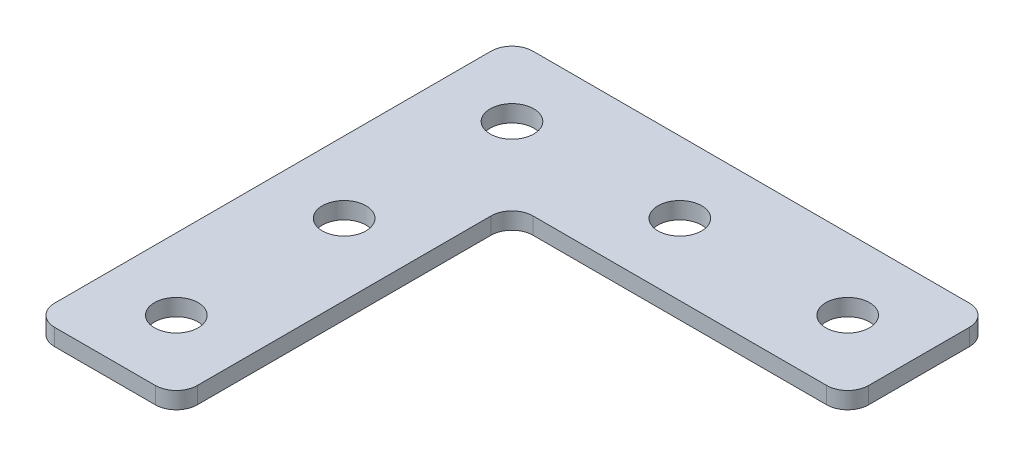
ISO-10303-21;
HEADER;
FILE_DESCRIPTION(('STEP AP214'),'2;1');
FILE_NAME('part.step','',(''),(''),'','','');
FILE_SCHEMA(('AUTOMOTIVE_DESIGN { 1 0 10303 214 1 1 1 1 }'));
ENDSEC;
DATA;
#1=APPLICATION_CONTEXT('core data for automotive mechanical design processes');
#2=APPLICATION_PROTOCOL_DEFINITION('international standard','automotive_design',2000,#1);
#3=PRODUCT_CONTEXT('',#1,'mechanical');
#4=PRODUCT('Part','Part','',(#3));
#5=PRODUCT_RELATED_PRODUCT_CATEGORY('part','',(#4));
#6=PRODUCT_DEFINITION_FORMATION('','',#4);
#7=PRODUCT_DEFINITION_CONTEXT('part definition',#1,'design');
#8=PRODUCT_DEFINITION('design','',#6,#7);
#9=PRODUCT_DEFINITION_SHAPE('','',#8);
#10=(LENGTH_UNIT() NAMED_UNIT(*) SI_UNIT(.MILLI.,.METRE.));
#11=(NAMED_UNIT(*) PLANE_ANGLE_UNIT() SI_UNIT($,.RADIAN.));
#12=(NAMED_UNIT(*) SI_UNIT($,.STERADIAN.) SOLID_ANGLE_UNIT());
#13=UNCERTAINTY_MEASURE_WITH_UNIT(LENGTH_MEASURE(1.E-05),#10,'distance_accuracy_value','');
#14=(GEOMETRIC_REPRESENTATION_CONTEXT(3) GLOBAL_UNCERTAINTY_ASSIGNED_CONTEXT((#13)) GLOBAL_UNIT_ASSIGNED_CONTEXT((#10,
#11,#12)) REPRESENTATION_CONTEXT('',''));
#15=CARTESIAN_POINT('',(0.,0.,0.));
#16=DIRECTION('',(0.,0.,1.));
#17=DIRECTION('',(1.,0.,0.));
#18=AXIS2_PLACEMENT_3D('',#15,#16,#17);
#19=CARTESIAN_POINT('',(-21.1576061309028,1.49134831028641,-21.3333372983197));
#20=DIRECTION('',(0.,-1.,0.));
#21=DIRECTION('',(0.,0.,-1.));
#22=AXIS2_PLACEMENT_3D('',#19,#20,#21);
#23=PLANE('',#22);
#24=CARTESIAN_POINT('',(18.8423938690972,1.49134831028641,-21.3333372983197));
#25=DIRECTION('',(0.,1.,0.));
#26=DIRECTION('',(0.,0.,1.));
#27=AXIS2_PLACEMENT_3D('',#24,#25,#26);
#28=CIRCLE('',#27,2.6);
#29=CARTESIAN_POINT('',(18.8423938690972,1.49134831028641,-18.7333372983197));
#30=VERTEX_POINT('',#29);
#31=EDGE_CURVE('E335',#30,#30,#28,.T.);
#32=ORIENTED_EDGE('',*,*,#31,.T.);
#33=EDGE_LOOP('',(#32));
#34=FACE_BOUND('',#33,.T.);
#35=CARTESIAN_POINT('',(-21.1576061309028,1.49134831028641,18.6666627016803));
#36=DIRECTION('',(0.,1.,0.));
#37=DIRECTION('',(0.,0.,1.));
#38=AXIS2_PLACEMENT_3D('',#35,#36,#37);
#39=CIRCLE('',#38,2.6);
#40=CARTESIAN_POINT('',(-21.1576061309028,1.49134831028641,21.2666627016803));
#41=VERTEX_POINT('',#40);
#42=EDGE_CURVE('E331',#41,#41,#39,.T.);
#43=ORIENTED_EDGE('',*,*,#42,.T.);
#44=EDGE_LOOP('',(#43));
#45=FACE_BOUND('',#44,.T.);
#46=CARTESIAN_POINT('',(-21.1576061309028,1.49134831028641,-1.3333372983197));
#47=DIRECTION('',(0.,1.,0.));
#48=DIRECTION('',(0.,0.,1.));
#49=AXIS2_PLACEMENT_3D('',#46,#47,#48);
#50=CIRCLE('',#49,2.6);
#51=CARTESIAN_POINT('',(-21.1576061309028,1.49134831028641,1.2666627016803));
#52=VERTEX_POINT('',#51);
#53=EDGE_CURVE('E327',#52,#52,#50,.T.);
#54=ORIENTED_EDGE('',*,*,#53,.T.);
#55=EDGE_LOOP('',(#54));
#56=FACE_BOUND('',#55,.T.);
#57=CARTESIAN_POINT('',(-1.15760613090281,1.49134831028641,-21.3333372983197));
#58=DIRECTION('',(0.,1.,0.));
#59=DIRECTION('',(0.,0.,1.));
#60=AXIS2_PLACEMENT_3D('',#57,#58,#59);
#61=CIRCLE('',#60,2.6);
#62=CARTESIAN_POINT('',(-1.15760613090281,1.49134831028641,-18.7333372983197));
#63=VERTEX_POINT('',#62);
#64=EDGE_CURVE('E321',#63,#63,#61,.T.);
#65=ORIENTED_EDGE('',*,*,#64,.T.);
#66=EDGE_LOOP('',(#65));
#67=FACE_BOUND('',#66,.T.);
#68=CARTESIAN_POINT('',(-21.1576061309028,1.49134831028641,-21.3333372983197));
#69=DIRECTION('',(0.,1.,0.));
#70=DIRECTION('',(0.,0.,1.));
#71=AXIS2_PLACEMENT_3D('',#68,#69,#70);
#72=CIRCLE('',#71,2.6);
#73=CARTESIAN_POINT('',(-21.1576061309028,1.49134831028641,-18.7333372983197));
#74=VERTEX_POINT('',#73);
#75=EDGE_CURVE('E187',#74,#74,#72,.T.);
#76=ORIENTED_EDGE('',*,*,#75,.T.);
#77=EDGE_LOOP('',(#76));
#78=FACE_BOUND('',#77,.T.);
#79=DIRECTION('',(-1.,0.,0.));
#80=VECTOR('',#79,1.);
#81=CARTESIAN_POINT('',(27.3423938690971,1.49134831028641,-29.8333372983198));
#82=LINE('',#81,#80);
#83=CARTESIAN_POINT('',(24.8423938690971,1.49134831028641,-29.8333372983198));
#84=VERTEX_POINT('',#83);
#85=CARTESIAN_POINT('',(-27.1576061309029,1.49134831028641,-29.8333372983197));
#86=VERTEX_POINT('',#85);
#87=EDGE_CURVE('E208',#84,#86,#82,.T.);
#88=ORIENTED_EDGE('',*,*,#87,.F.);
#89=CARTESIAN_POINT('',(24.8423938690971,1.49134831028641,-27.3333372983198));
#90=DIRECTION('',(0.,-1.,0.));
#91=DIRECTION('',(0.,0.,-1.));
#92=AXIS2_PLACEMENT_3D('',#89,#90,#91);
#93=CIRCLE('',#92,2.5);
#94=CARTESIAN_POINT('',(27.3423938690971,1.49134831028641,-27.3333372983198));
#95=VERTEX_POINT('',#94);
#96=EDGE_CURVE('E159',#84,#95,#93,.T.);
#97=ORIENTED_EDGE('',*,*,#96,.T.);
#98=DIRECTION('',(0.,0.,-1.));
#99=VECTOR('',#98,1.);
#100=CARTESIAN_POINT('',(27.3423938690971,1.49134831028641,-12.8333372983197));
#101=LINE('',#100,#99);
#102=CARTESIAN_POINT('',(27.3423938690971,1.49134831028641,-15.3333372983197));
#103=VERTEX_POINT('',#102);
#104=EDGE_CURVE('E217',#103,#95,#101,.T.);
#105=ORIENTED_EDGE('',*,*,#104,.F.);
#106=CARTESIAN_POINT('',(24.8423938690971,1.49134831028641,-15.3333372983197));
#107=DIRECTION('',(0.,-1.,0.));
#108=DIRECTION('',(0.,0.,-1.));
#109=AXIS2_PLACEMENT_3D('',#106,#107,#108);
#110=CIRCLE('',#109,2.5);
#111=CARTESIAN_POINT('',(24.8423938690971,1.49134831028641,-12.8333372983197));
#112=VERTEX_POINT('',#111);
#113=EDGE_CURVE('E131',#103,#112,#110,.T.);
#114=ORIENTED_EDGE('',*,*,#113,.T.);
#115=DIRECTION('',(1.,0.,0.));
#116=VECTOR('',#115,1.);
#117=CARTESIAN_POINT('',(-12.6576061309028,1.49134831028641,-12.8333372983197));
#118=LINE('',#117,#116);
#119=CARTESIAN_POINT('',(-10.1576061309028,1.49134831028641,-12.8333372983197));
#120=VERTEX_POINT('',#119);
#121=EDGE_CURVE('E194',#120,#112,#118,.T.);
#122=ORIENTED_EDGE('',*,*,#121,.F.);
#123=CARTESIAN_POINT('',(-10.1576061309028,1.49134831028641,-10.3333372983197));
#124=DIRECTION('',(0.,-1.,0.));
#125=DIRECTION('',(0.,0.,-1.));
#126=AXIS2_PLACEMENT_3D('',#123,#124,#125);
#127=CIRCLE('',#126,2.5);
#128=CARTESIAN_POINT('',(-12.6576061309028,1.49134831028641,-10.3333372983197));
#129=VERTEX_POINT('',#128);
#130=EDGE_CURVE('E10',#120,#129,#127,.F.);
#131=ORIENTED_EDGE('',*,*,#130,.T.);
#132=DIRECTION('',(0.,0.,-1.));
#133=VECTOR('',#132,1.);
#134=CARTESIAN_POINT('',(-12.6576061309028,1.49134831028641,27.1666627016803));
#135=LINE('',#134,#133);
#136=CARTESIAN_POINT('',(-12.6576061309028,1.49134831028641,24.6666627016803));
#137=VERTEX_POINT('',#136);
#138=EDGE_CURVE('E132',#137,#129,#135,.T.);
#139=ORIENTED_EDGE('',*,*,#138,.F.);
#140=CARTESIAN_POINT('',(-15.1576061309028,1.49134831028641,24.6666627016803));
#141=DIRECTION('',(0.,-1.,0.));
#142=DIRECTION('',(0.,0.,-1.));
#143=AXIS2_PLACEMENT_3D('',#140,#141,#142);
#144=CIRCLE('',#143,2.5);
#145=CARTESIAN_POINT('',(-15.1576061309028,1.49134831028641,27.1666627016803));
#146=VERTEX_POINT('',#145);
#147=EDGE_CURVE('E153',#137,#146,#144,.T.);
#148=ORIENTED_EDGE('',*,*,#147,.T.);
#149=DIRECTION('',(1.,0.,0.));
#150=VECTOR('',#149,1.);
#151=CARTESIAN_POINT('',(-29.6576061309029,1.49134831028641,27.1666627016803));
#152=LINE('',#151,#150);
#153=CARTESIAN_POINT('',(-27.1576061309029,1.49134831028641,27.1666627016803));
#154=VERTEX_POINT('',#153);
#155=EDGE_CURVE('E136',#154,#146,#152,.T.);
#156=ORIENTED_EDGE('',*,*,#155,.F.);
#157=CARTESIAN_POINT('',(-27.1576061309029,1.49134831028641,24.6666627016803));
#158=DIRECTION('',(0.,-1.,0.));
#159=DIRECTION('',(0.,0.,-1.));
#160=AXIS2_PLACEMENT_3D('',#157,#158,#159);
#161=CIRCLE('',#160,2.5);
#162=CARTESIAN_POINT('',(-29.6576061309029,1.49134831028641,24.6666627016803));
#163=VERTEX_POINT('',#162);
#164=EDGE_CURVE('E31',#154,#163,#161,.T.);
#165=ORIENTED_EDGE('',*,*,#164,.T.);
#166=DIRECTION('',(0.,0.,1.));
#167=VECTOR('',#166,1.);
#168=CARTESIAN_POINT('',(-29.6576061309029,1.49134831028641,-29.8333372983197));
#169=LINE('',#168,#167);
#170=CARTESIAN_POINT('',(-29.6576061309029,1.49134831028641,-27.3333372983197));
#171=VERTEX_POINT('',#170);
#172=EDGE_CURVE('E206',#171,#163,#169,.T.);
#173=ORIENTED_EDGE('',*,*,#172,.F.);
#174=CARTESIAN_POINT('',(-27.1576061309029,1.49134831028641,-27.3333372983197));
#175=DIRECTION('',(0.,-1.,0.));
#176=DIRECTION('',(0.,0.,-1.));
#177=AXIS2_PLACEMENT_3D('',#174,#175,#176);
#178=CIRCLE('',#177,2.5);
#179=EDGE_CURVE('E157',#171,#86,#178,.T.);
#180=ORIENTED_EDGE('',*,*,#179,.T.);
#181=EDGE_LOOP('',(#88,#97,#105,#114,#122,#131,#139,#148,#156,#165,#173,#180));
#182=FACE_BOUND('',#181,.T.);
#183=ADVANCED_FACE('F16',(#34,#45,#56,#67,#78,#182),#23,.T.);
#184=CARTESIAN_POINT('',(-12.6576061309028,1.49134831028641,-12.8333372983197));
#185=DIRECTION('',(0.,0.,1.));
#186=DIRECTION('',(1.,0.,0.));
#187=AXIS2_PLACEMENT_3D('',#184,#185,#186);
#188=PLANE('',#187);
#189=DIRECTION('',(1.,0.,0.));
#190=VECTOR('',#189,1.);
#191=CARTESIAN_POINT('',(-12.6576061309028,3.49134831028641,-12.8333372983197));
#192=LINE('',#191,#190);
#193=CARTESIAN_POINT('',(-10.1576061309028,3.49134831028641,-12.8333372983197));
#194=VERTEX_POINT('',#193);
#195=CARTESIAN_POINT('',(24.8423938690971,3.49134831028641,-12.8333372983197));
#196=VERTEX_POINT('',#195);
#197=EDGE_CURVE('E111',#194,#196,#192,.T.);
#198=ORIENTED_EDGE('',*,*,#197,.F.);
#199=DIRECTION('',(0.,1.,0.));
#200=VECTOR('',#199,1.);
#201=CARTESIAN_POINT('',(-10.1576061309028,1.49134831028641,-12.8333372983197));
#202=LINE('',#201,#200);
#203=EDGE_CURVE('E177',#194,#120,#202,.F.);
#204=ORIENTED_EDGE('',*,*,#203,.T.);
#205=ORIENTED_EDGE('',*,*,#121,.T.);
#206=DIRECTION('',(0.,1.,0.));
#207=VECTOR('',#206,1.);
#208=CARTESIAN_POINT('',(24.8423938690971,1.49134831028641,-12.8333372983197));
#209=LINE('',#208,#207);
#210=EDGE_CURVE('E175',#112,#196,#209,.T.);
#211=ORIENTED_EDGE('',*,*,#210,.T.);
#212=EDGE_LOOP('',(#198,#204,#205,#211));
#213=FACE_BOUND('',#212,.T.);
#214=ADVANCED_FACE('F184',(#213),#188,.T.);
#215=CARTESIAN_POINT('',(-12.6576061309028,1.49134831028641,27.1666627016803));
#216=DIRECTION('',(1.,0.,0.));
#217=DIRECTION('',(0.,0.,-1.));
#218=AXIS2_PLACEMENT_3D('',#215,#216,#217);
#219=PLANE('',#218);
#220=ORIENTED_EDGE('',*,*,#138,.T.);
#221=DIRECTION('',(0.,1.,0.));
#222=VECTOR('',#221,1.);
#223=CARTESIAN_POINT('',(-12.6576061309028,3.49134831028641,-10.3333372983197));
#224=LINE('',#223,#222);
#225=CARTESIAN_POINT('',(-12.6576061309028,3.49134831028641,-10.3333372983197));
#226=VERTEX_POINT('',#225);
#227=EDGE_CURVE('E172',#129,#226,#224,.T.);
#228=ORIENTED_EDGE('',*,*,#227,.T.);
#229=DIRECTION('',(0.,0.,-1.));
#230=VECTOR('',#229,1.);
#231=CARTESIAN_POINT('',(-12.6576061309028,3.49134831028641,27.1666627016803));
#232=LINE('',#231,#230);
#233=CARTESIAN_POINT('',(-12.6576061309028,3.49134831028641,24.6666627016803));
#234=VERTEX_POINT('',#233);
#235=EDGE_CURVE('E139',#234,#226,#232,.T.);
#236=ORIENTED_EDGE('',*,*,#235,.F.);
#237=DIRECTION('',(0.,1.,0.));
#238=VECTOR('',#237,1.);
#239=CARTESIAN_POINT('',(-12.6576061309028,1.49134831028641,24.6666627016803));
#240=LINE('',#239,#238);
#241=EDGE_CURVE('E170',#234,#137,#240,.F.);
#242=ORIENTED_EDGE('',*,*,#241,.T.);
#243=EDGE_LOOP('',(#220,#228,#236,#242));
#244=FACE_BOUND('',#243,.T.);
#245=ADVANCED_FACE('F196',(#244),#219,.T.);
#246=CARTESIAN_POINT('',(-29.6576061309029,1.49134831028641,27.1666627016803));
#247=DIRECTION('',(0.,0.,1.));
#248=DIRECTION('',(1.,0.,0.));
#249=AXIS2_PLACEMENT_3D('',#246,#247,#248);
#250=PLANE('',#249);
#251=DIRECTION('',(1.,0.,0.));
#252=VECTOR('',#251,1.);
#253=CARTESIAN_POINT('',(-29.6576061309029,3.49134831028641,27.1666627016803));
#254=LINE('',#253,#252);
#255=CARTESIAN_POINT('',(-27.1576061309029,3.49134831028641,27.1666627016803));
#256=VERTEX_POINT('',#255);
#257=CARTESIAN_POINT('',(-15.1576061309028,3.49134831028641,27.1666627016803));
#258=VERTEX_POINT('',#257);
#259=EDGE_CURVE('E216',#256,#258,#254,.T.);
#260=ORIENTED_EDGE('',*,*,#259,.F.);
#261=DIRECTION('',(0.,1.,0.));
#262=VECTOR('',#261,1.);
#263=CARTESIAN_POINT('',(-27.1576061309029,1.49134831028641,27.1666627016803));
#264=LINE('',#263,#262);
#265=EDGE_CURVE('E168',#256,#154,#264,.F.);
#266=ORIENTED_EDGE('',*,*,#265,.T.);
#267=ORIENTED_EDGE('',*,*,#155,.T.);
#268=DIRECTION('',(0.,1.,0.));
#269=VECTOR('',#268,1.);
#270=CARTESIAN_POINT('',(-15.1576061309028,1.49134831028641,27.1666627016803));
#271=LINE('',#270,#269);
#272=EDGE_CURVE('E165',#146,#258,#271,.T.);
#273=ORIENTED_EDGE('',*,*,#272,.T.);
#274=EDGE_LOOP('',(#260,#266,#267,#273));
#275=FACE_BOUND('',#274,.T.);
#276=ADVANCED_FACE('F203',(#275),#250,.T.);
#277=CARTESIAN_POINT('',(-29.6576061309029,1.49134831028641,-29.8333372983197));
#278=DIRECTION('',(-1.,0.,0.));
#279=DIRECTION('',(0.,0.,1.));
#280=AXIS2_PLACEMENT_3D('',#277,#278,#279);
#281=PLANE('',#280);
#282=DIRECTION('',(0.,0.,1.));
#283=VECTOR('',#282,1.);
#284=CARTESIAN_POINT('',(-29.6576061309029,3.49134831028641,-29.8333372983197));
#285=LINE('',#284,#283);
#286=CARTESIAN_POINT('',(-29.6576061309029,3.49134831028641,-27.3333372983197));
#287=VERTEX_POINT('',#286);
#288=CARTESIAN_POINT('',(-29.6576061309029,3.49134831028641,24.6666627016803));
#289=VERTEX_POINT('',#288);
#290=EDGE_CURVE('E214',#287,#289,#285,.T.);
#291=ORIENTED_EDGE('',*,*,#290,.F.);
#292=DIRECTION('',(0.,1.,0.));
#293=VECTOR('',#292,1.);
#294=CARTESIAN_POINT('',(-29.6576061309029,1.49134831028641,-27.3333372983197));
#295=LINE('',#294,#293);
#296=EDGE_CURVE('E38',#287,#171,#295,.F.);
#297=ORIENTED_EDGE('',*,*,#296,.T.);
#298=ORIENTED_EDGE('',*,*,#172,.T.);
#299=DIRECTION('',(0.,1.,0.));
#300=VECTOR('',#299,1.);
#301=CARTESIAN_POINT('',(-29.6576061309029,1.49134831028641,24.6666627016803));
#302=LINE('',#301,#300);
#303=EDGE_CURVE('E161',#163,#289,#302,.T.);
#304=ORIENTED_EDGE('',*,*,#303,.T.);
#305=EDGE_LOOP('',(#291,#297,#298,#304));
#306=FACE_BOUND('',#305,.T.);
#307=ADVANCED_FACE('F233',(#306),#281,.T.);
#308=CARTESIAN_POINT('',(27.3423938690971,1.49134831028641,-29.8333372983198));
#309=DIRECTION('',(0.,0.,-1.));
#310=DIRECTION('',(-1.,0.,0.));
#311=AXIS2_PLACEMENT_3D('',#308,#309,#310);
#312=PLANE('',#311);
#313=DIRECTION('',(-1.,0.,0.));
#314=VECTOR('',#313,1.);
#315=CARTESIAN_POINT('',(27.3423938690971,3.49134831028641,-29.8333372983198));
#316=LINE('',#315,#314);
#317=CARTESIAN_POINT('',(24.8423938690971,3.49134831028641,-29.8333372983198));
#318=VERTEX_POINT('',#317);
#319=CARTESIAN_POINT('',(-27.1576061309029,3.49134831028641,-29.8333372983197));
#320=VERTEX_POINT('',#319);
#321=EDGE_CURVE('E127',#318,#320,#316,.T.);
#322=ORIENTED_EDGE('',*,*,#321,.F.);
#323=DIRECTION('',(0.,1.,0.));
#324=VECTOR('',#323,1.);
#325=CARTESIAN_POINT('',(24.8423938690971,1.49134831028641,-29.8333372983198));
#326=LINE('',#325,#324);
#327=EDGE_CURVE('E151',#318,#84,#326,.F.);
#328=ORIENTED_EDGE('',*,*,#327,.T.);
#329=ORIENTED_EDGE('',*,*,#87,.T.);
#330=DIRECTION('',(0.,1.,0.));
#331=VECTOR('',#330,1.);
#332=CARTESIAN_POINT('',(-27.1576061309029,1.49134831028641,-29.8333372983197));
#333=LINE('',#332,#331);
#334=EDGE_CURVE('E148',#86,#320,#333,.T.);
#335=ORIENTED_EDGE('',*,*,#334,.T.);
#336=EDGE_LOOP('',(#322,#328,#329,#335));
#337=FACE_BOUND('',#336,.T.);
#338=ADVANCED_FACE('F227',(#337),#312,.T.);
#339=CARTESIAN_POINT('',(27.3423938690971,1.49134831028641,-12.8333372983197));
#340=DIRECTION('',(1.,0.,0.));
#341=DIRECTION('',(0.,0.,-1.));
#342=AXIS2_PLACEMENT_3D('',#339,#340,#341);
#343=PLANE('',#342);
#344=ORIENTED_EDGE('',*,*,#104,.T.);
#345=DIRECTION('',(0.,1.,0.));
#346=VECTOR('',#345,1.);
#347=CARTESIAN_POINT('',(27.3423938690971,1.49134831028641,-27.3333372983198));
#348=LINE('',#347,#346);
#349=CARTESIAN_POINT('',(27.3423938690971,3.49134831028641,-27.3333372983198));
#350=VERTEX_POINT('',#349);
#351=EDGE_CURVE('E126',#95,#350,#348,.T.);
#352=ORIENTED_EDGE('',*,*,#351,.T.);
#353=DIRECTION('',(0.,0.,-1.));
#354=VECTOR('',#353,1.);
#355=CARTESIAN_POINT('',(27.3423938690971,3.49134831028641,-12.8333372983197));
#356=LINE('',#355,#354);
#357=CARTESIAN_POINT('',(27.3423938690971,3.49134831028641,-15.3333372983197));
#358=VERTEX_POINT('',#357);
#359=EDGE_CURVE('E109',#358,#350,#356,.T.);
#360=ORIENTED_EDGE('',*,*,#359,.F.);
#361=DIRECTION('',(0.,1.,0.));
#362=VECTOR('',#361,1.);
#363=CARTESIAN_POINT('',(27.3423938690971,1.49134831028641,-15.3333372983197));
#364=LINE('',#363,#362);
#365=EDGE_CURVE('E123',#358,#103,#364,.F.);
#366=ORIENTED_EDGE('',*,*,#365,.T.);
#367=EDGE_LOOP('',(#344,#352,#360,#366));
#368=FACE_BOUND('',#367,.T.);
#369=ADVANCED_FACE('F122',(#368),#343,.T.);
#370=CARTESIAN_POINT('',(-21.1576061309028,3.49134831028641,-21.3333372983197));
#371=DIRECTION('',(0.,-1.,0.));
#372=DIRECTION('',(0.,0.,-1.));
#373=AXIS2_PLACEMENT_3D('',#370,#371,#372);
#374=PLANE('',#373);
#375=CARTESIAN_POINT('',(18.8423938690972,3.49134831028641,-21.3333372983197));
#376=DIRECTION('',(0.,1.,0.));
#377=DIRECTION('',(0.,0.,1.));
#378=AXIS2_PLACEMENT_3D('',#375,#376,#377);
#379=CIRCLE('',#378,2.6);
#380=CARTESIAN_POINT('',(18.8423938690972,3.49134831028641,-18.7333372983197));
#381=VERTEX_POINT('',#380);
#382=EDGE_CURVE('E305',#381,#381,#379,.T.);
#383=ORIENTED_EDGE('',*,*,#382,.F.);
#384=EDGE_LOOP('',(#383));
#385=FACE_BOUND('',#384,.T.);
#386=CARTESIAN_POINT('',(-21.1576061309028,3.49134831028641,18.6666627016803));
#387=DIRECTION('',(0.,1.,0.));
#388=DIRECTION('',(0.,0.,1.));
#389=AXIS2_PLACEMENT_3D('',#386,#387,#388);
#390=CIRCLE('',#389,2.6);
#391=CARTESIAN_POINT('',(-21.1576061309028,3.49134831028641,21.2666627016803));
#392=VERTEX_POINT('',#391);
#393=EDGE_CURVE('E309',#392,#392,#390,.T.);
#394=ORIENTED_EDGE('',*,*,#393,.F.);
#395=EDGE_LOOP('',(#394));
#396=FACE_BOUND('',#395,.T.);
#397=CARTESIAN_POINT('',(-21.1576061309028,3.49134831028641,-1.3333372983197));
#398=DIRECTION('',(0.,1.,0.));
#399=DIRECTION('',(0.,0.,1.));
#400=AXIS2_PLACEMENT_3D('',#397,#398,#399);
#401=CIRCLE('',#400,2.6);
#402=CARTESIAN_POINT('',(-21.1576061309028,3.49134831028641,1.2666627016803));
#403=VERTEX_POINT('',#402);
#404=EDGE_CURVE('E313',#403,#403,#401,.T.);
#405=ORIENTED_EDGE('',*,*,#404,.F.);
#406=EDGE_LOOP('',(#405));
#407=FACE_BOUND('',#406,.T.);
#408=CARTESIAN_POINT('',(-1.15760613090281,3.49134831028641,-21.3333372983197));
#409=DIRECTION('',(0.,1.,0.));
#410=DIRECTION('',(0.,0.,1.));
#411=AXIS2_PLACEMENT_3D('',#408,#409,#410);
#412=CIRCLE('',#411,2.6);
#413=CARTESIAN_POINT('',(-1.15760613090281,3.49134831028641,-18.7333372983197));
#414=VERTEX_POINT('',#413);
#415=EDGE_CURVE('E317',#414,#414,#412,.T.);
#416=ORIENTED_EDGE('',*,*,#415,.F.);
#417=EDGE_LOOP('',(#416));
#418=FACE_BOUND('',#417,.T.);
#419=CARTESIAN_POINT('',(-21.1576061309028,3.49134831028641,-21.3333372983197));
#420=DIRECTION('',(0.,1.,0.));
#421=DIRECTION('',(0.,0.,1.));
#422=AXIS2_PLACEMENT_3D('',#419,#420,#421);
#423=CIRCLE('',#422,2.6);
#424=CARTESIAN_POINT('',(-21.1576061309028,3.49134831028641,-18.7333372983197));
#425=VERTEX_POINT('',#424);
#426=EDGE_CURVE('E221',#425,#425,#423,.T.);
#427=ORIENTED_EDGE('',*,*,#426,.F.);
#428=EDGE_LOOP('',(#427));
#429=FACE_BOUND('',#428,.T.);
#430=ORIENTED_EDGE('',*,*,#359,.T.);
#431=CARTESIAN_POINT('',(24.8423938690971,3.49134831028641,-27.3333372983198));
#432=DIRECTION('',(0.,-1.,0.));
#433=DIRECTION('',(0.,0.,-1.));
#434=AXIS2_PLACEMENT_3D('',#431,#432,#433);
#435=CIRCLE('',#434,2.5);
#436=EDGE_CURVE('E146',#350,#318,#435,.F.);
#437=ORIENTED_EDGE('',*,*,#436,.T.);
#438=ORIENTED_EDGE('',*,*,#321,.T.);
#439=CARTESIAN_POINT('',(-27.1576061309029,3.49134831028641,-27.3333372983197));
#440=DIRECTION('',(0.,-1.,0.));
#441=DIRECTION('',(0.,0.,-1.));
#442=AXIS2_PLACEMENT_3D('',#439,#440,#441);
#443=CIRCLE('',#442,2.5);
#444=EDGE_CURVE('E144',#320,#287,#443,.F.);
#445=ORIENTED_EDGE('',*,*,#444,.T.);
#446=ORIENTED_EDGE('',*,*,#290,.T.);
#447=CARTESIAN_POINT('',(-27.1576061309029,3.49134831028641,24.6666627016803));
#448=DIRECTION('',(0.,-1.,0.));
#449=DIRECTION('',(0.,0.,-1.));
#450=AXIS2_PLACEMENT_3D('',#447,#448,#449);
#451=CIRCLE('',#450,2.5);
#452=EDGE_CURVE('E116',#289,#256,#451,.F.);
#453=ORIENTED_EDGE('',*,*,#452,.T.);
#454=ORIENTED_EDGE('',*,*,#259,.T.);
#455=CARTESIAN_POINT('',(-15.1576061309028,3.49134831028641,24.6666627016803));
#456=DIRECTION('',(0.,-1.,0.));
#457=DIRECTION('',(0.,0.,-1.));
#458=AXIS2_PLACEMENT_3D('',#455,#456,#457);
#459=CIRCLE('',#458,2.5);
#460=EDGE_CURVE('E117',#258,#234,#459,.F.);
#461=ORIENTED_EDGE('',*,*,#460,.T.);
#462=ORIENTED_EDGE('',*,*,#235,.T.);
#463=CARTESIAN_POINT('',(-10.1576061309028,3.49134831028641,-10.3333372983197));
#464=DIRECTION('',(0.,-1.,0.));
#465=DIRECTION('',(0.,0.,-1.));
#466=AXIS2_PLACEMENT_3D('',#463,#464,#465);
#467=CIRCLE('',#466,2.5);
#468=EDGE_CURVE('E24',#226,#194,#467,.T.);
#469=ORIENTED_EDGE('',*,*,#468,.T.);
#470=ORIENTED_EDGE('',*,*,#197,.T.);
#471=CARTESIAN_POINT('',(24.8423938690971,3.49134831028641,-15.3333372983197));
#472=DIRECTION('',(0.,-1.,0.));
#473=DIRECTION('',(0.,0.,-1.));
#474=AXIS2_PLACEMENT_3D('',#471,#472,#473);
#475=CIRCLE('',#474,2.5);
#476=EDGE_CURVE('E106',#196,#358,#475,.F.);
#477=ORIENTED_EDGE('',*,*,#476,.T.);
#478=EDGE_LOOP('',(#430,#437,#438,#445,#446,#453,#454,#461,#462,#469,#470,#477));
#479=FACE_BOUND('',#478,.T.);
#480=ADVANCED_FACE('F108',(#385,#396,#407,#418,#429,#479),#374,.F.);
#481=CARTESIAN_POINT('',(-21.1576061309028,1.49134831028641,-21.3333372983197));
#482=DIRECTION('',(0.,1.,0.));
#483=DIRECTION('',(0.,0.,1.));
#484=AXIS2_PLACEMENT_3D('',#481,#482,#483);
#485=CYLINDRICAL_SURFACE('',#484,2.6);
#486=ORIENTED_EDGE('',*,*,#75,.F.);
#487=EDGE_LOOP('',(#486));
#488=FACE_BOUND('',#487,.T.);
#489=ORIENTED_EDGE('',*,*,#426,.T.);
#490=EDGE_LOOP('',(#489));
#491=FACE_BOUND('',#490,.T.);
#492=ADVANCED_FACE('F282',(#488,#491),#485,.F.);
#493=CARTESIAN_POINT('',(-1.15760613090281,1.49134831028641,-21.3333372983197));
#494=DIRECTION('',(0.,1.,0.));
#495=DIRECTION('',(0.,0.,1.));
#496=AXIS2_PLACEMENT_3D('',#493,#494,#495);
#497=CYLINDRICAL_SURFACE('',#496,2.6);
#498=ORIENTED_EDGE('',*,*,#64,.F.);
#499=EDGE_LOOP('',(#498));
#500=FACE_BOUND('',#499,.T.);
#501=ORIENTED_EDGE('',*,*,#415,.T.);
#502=EDGE_LOOP('',(#501));
#503=FACE_BOUND('',#502,.T.);
#504=ADVANCED_FACE('F278',(#500,#503),#497,.F.);
#505=CARTESIAN_POINT('',(-21.1576061309028,1.49134831028641,-1.3333372983197));
#506=DIRECTION('',(0.,1.,0.));
#507=DIRECTION('',(0.,0.,1.));
#508=AXIS2_PLACEMENT_3D('',#505,#506,#507);
#509=CYLINDRICAL_SURFACE('',#508,2.6);
#510=ORIENTED_EDGE('',*,*,#53,.F.);
#511=EDGE_LOOP('',(#510));
#512=FACE_BOUND('',#511,.T.);
#513=ORIENTED_EDGE('',*,*,#404,.T.);
#514=EDGE_LOOP('',(#513));
#515=FACE_BOUND('',#514,.T.);
#516=ADVANCED_FACE('F270',(#512,#515),#509,.F.);
#517=CARTESIAN_POINT('',(-21.1576061309028,1.49134831028641,18.6666627016803));
#518=DIRECTION('',(0.,1.,0.));
#519=DIRECTION('',(0.,0.,1.));
#520=AXIS2_PLACEMENT_3D('',#517,#518,#519);
#521=CYLINDRICAL_SURFACE('',#520,2.6);
#522=ORIENTED_EDGE('',*,*,#42,.F.);
#523=EDGE_LOOP('',(#522));
#524=FACE_BOUND('',#523,.T.);
#525=ORIENTED_EDGE('',*,*,#393,.T.);
#526=EDGE_LOOP('',(#525));
#527=FACE_BOUND('',#526,.T.);
#528=ADVANCED_FACE('F264',(#524,#527),#521,.F.);
#529=CARTESIAN_POINT('',(18.8423938690972,1.49134831028641,-21.3333372983197));
#530=DIRECTION('',(0.,1.,0.));
#531=DIRECTION('',(0.,0.,1.));
#532=AXIS2_PLACEMENT_3D('',#529,#530,#531);
#533=CYLINDRICAL_SURFACE('',#532,2.6);
#534=ORIENTED_EDGE('',*,*,#31,.F.);
#535=EDGE_LOOP('',(#534));
#536=FACE_BOUND('',#535,.T.);
#537=ORIENTED_EDGE('',*,*,#382,.T.);
#538=EDGE_LOOP('',(#537));
#539=FACE_BOUND('',#538,.T.);
#540=ADVANCED_FACE('F259',(#536,#539),#533,.F.);
#541=CARTESIAN_POINT('',(24.8423938690971,1.49134831028641,-27.3333372983198));
#542=DIRECTION('',(0.,1.,0.));
#543=DIRECTION('',(0.,0.,1.));
#544=AXIS2_PLACEMENT_3D('',#541,#542,#543);
#545=CYLINDRICAL_SURFACE('',#544,2.5);
#546=ORIENTED_EDGE('',*,*,#96,.F.);
#547=ORIENTED_EDGE('',*,*,#327,.F.);
#548=ORIENTED_EDGE('',*,*,#436,.F.);
#549=ORIENTED_EDGE('',*,*,#351,.F.);
#550=EDGE_LOOP('',(#546,#547,#548,#549));
#551=FACE_BOUND('',#550,.T.);
#552=ADVANCED_FACE('F245',(#551),#545,.T.);
#553=CARTESIAN_POINT('',(-27.1576061309029,1.49134831028641,-27.3333372983197));
#554=DIRECTION('',(0.,1.,0.));
#555=DIRECTION('',(0.,0.,1.));
#556=AXIS2_PLACEMENT_3D('',#553,#554,#555);
#557=CYLINDRICAL_SURFACE('',#556,2.5);
#558=ORIENTED_EDGE('',*,*,#179,.F.);
#559=ORIENTED_EDGE('',*,*,#296,.F.);
#560=ORIENTED_EDGE('',*,*,#444,.F.);
#561=ORIENTED_EDGE('',*,*,#334,.F.);
#562=EDGE_LOOP('',(#558,#559,#560,#561));
#563=FACE_BOUND('',#562,.T.);
#564=ADVANCED_FACE('F232',(#563),#557,.T.);
#565=CARTESIAN_POINT('',(-27.1576061309029,1.49134831028641,24.6666627016803));
#566=DIRECTION('',(0.,1.,0.));
#567=DIRECTION('',(0.,0.,1.));
#568=AXIS2_PLACEMENT_3D('',#565,#566,#567);
#569=CYLINDRICAL_SURFACE('',#568,2.5);
#570=ORIENTED_EDGE('',*,*,#164,.F.);
#571=ORIENTED_EDGE('',*,*,#265,.F.);
#572=ORIENTED_EDGE('',*,*,#452,.F.);
#573=ORIENTED_EDGE('',*,*,#303,.F.);
#574=EDGE_LOOP('',(#570,#571,#572,#573));
#575=FACE_BOUND('',#574,.T.);
#576=ADVANCED_FACE('F236',(#575),#569,.T.);
#577=CARTESIAN_POINT('',(-10.1576061309028,1.49134831028641,-10.3333372983197));
#578=DIRECTION('',(0.,-1.,0.));
#579=DIRECTION('',(0.,0.,-1.));
#580=AXIS2_PLACEMENT_3D('',#577,#578,#579);
#581=CYLINDRICAL_SURFACE('',#580,2.5);
#582=ORIENTED_EDGE('',*,*,#130,.F.);
#583=ORIENTED_EDGE('',*,*,#203,.F.);
#584=ORIENTED_EDGE('',*,*,#468,.F.);
#585=ORIENTED_EDGE('',*,*,#227,.F.);
#586=EDGE_LOOP('',(#582,#583,#584,#585));
#587=FACE_BOUND('',#586,.T.);
#588=ADVANCED_FACE('F190',(#587),#581,.F.);
#589=CARTESIAN_POINT('',(24.8423938690971,1.49134831028641,-15.3333372983197));
#590=DIRECTION('',(0.,1.,0.));
#591=DIRECTION('',(0.,0.,1.));
#592=AXIS2_PLACEMENT_3D('',#589,#590,#591);
#593=CYLINDRICAL_SURFACE('',#592,2.5);
#594=ORIENTED_EDGE('',*,*,#113,.F.);
#595=ORIENTED_EDGE('',*,*,#365,.F.);
#596=ORIENTED_EDGE('',*,*,#476,.F.);
#597=ORIENTED_EDGE('',*,*,#210,.F.);
#598=EDGE_LOOP('',(#594,#595,#596,#597));
#599=FACE_BOUND('',#598,.T.);
#600=ADVANCED_FACE('F130',(#599),#593,.T.);
#601=CARTESIAN_POINT('',(-15.1576061309028,1.49134831028641,24.6666627016803));
#602=DIRECTION('',(0.,1.,0.));
#603=DIRECTION('',(0.,0.,1.));
#604=AXIS2_PLACEMENT_3D('',#601,#602,#603);
#605=CYLINDRICAL_SURFACE('',#604,2.5);
#606=ORIENTED_EDGE('',*,*,#147,.F.);
#607=ORIENTED_EDGE('',*,*,#241,.F.);
#608=ORIENTED_EDGE('',*,*,#460,.F.);
#609=ORIENTED_EDGE('',*,*,#272,.F.);
#610=EDGE_LOOP('',(#606,#607,#608,#609));
#611=FACE_BOUND('',#610,.T.);
#612=ADVANCED_FACE('F18',(#611),#605,.T.);
#613=CLOSED_SHELL('',(#183,#214,#245,#276,#307,#338,#369,#480,#492,#504,#516,#528,#540,#552,
#564,#576,#588,#600,#612));
#614=MANIFOLD_SOLID_BREP('B1',#613);
#615=ADVANCED_BREP_SHAPE_REPRESENTATION('',(#18,#614),#14);
#616=SHAPE_DEFINITION_REPRESENTATION(#9,#615);
ENDSEC;
END-ISO-10303-21;
